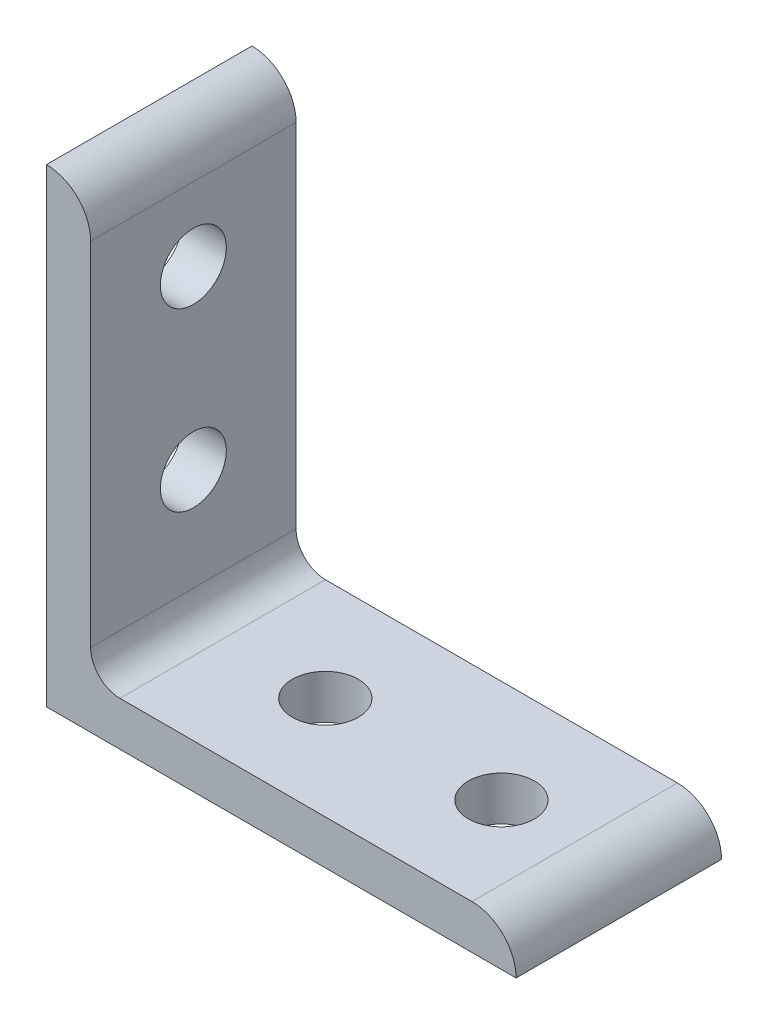
ISO-10303-21;
HEADER;
FILE_DESCRIPTION(('STEP AP214'),'2;1');
FILE_NAME('part.step','',(''),(''),'','','');
FILE_SCHEMA(('AUTOMOTIVE_DESIGN { 1 0 10303 214 1 1 1 1 }'));
ENDSEC;
DATA;
#1=APPLICATION_CONTEXT('core data for automotive mechanical design processes');
#2=APPLICATION_PROTOCOL_DEFINITION('international standard','automotive_design',2000,#1);
#3=PRODUCT_CONTEXT('',#1,'mechanical');
#4=PRODUCT('Part','Part','',(#3));
#5=PRODUCT_RELATED_PRODUCT_CATEGORY('part','',(#4));
#6=PRODUCT_DEFINITION_FORMATION('','',#4);
#7=PRODUCT_DEFINITION_CONTEXT('part definition',#1,'design');
#8=PRODUCT_DEFINITION('design','',#6,#7);
#9=PRODUCT_DEFINITION_SHAPE('','',#8);
#10=(LENGTH_UNIT() NAMED_UNIT(*) SI_UNIT(.MILLI.,.METRE.));
#11=(NAMED_UNIT(*) PLANE_ANGLE_UNIT() SI_UNIT($,.RADIAN.));
#12=(NAMED_UNIT(*) SI_UNIT($,.STERADIAN.) SOLID_ANGLE_UNIT());
#13=UNCERTAINTY_MEASURE_WITH_UNIT(LENGTH_MEASURE(1.E-05),#10,'distance_accuracy_value','');
#14=(GEOMETRIC_REPRESENTATION_CONTEXT(3) GLOBAL_UNCERTAINTY_ASSIGNED_CONTEXT((#13)) GLOBAL_UNIT_ASSIGNED_CONTEXT((#10,
#11,#12)) REPRESENTATION_CONTEXT('',''));
#15=CARTESIAN_POINT('',(0.,0.,0.));
#16=DIRECTION('',(0.,0.,1.));
#17=DIRECTION('',(1.,0.,0.));
#18=AXIS2_PLACEMENT_3D('',#15,#16,#17);
#19=CARTESIAN_POINT('',(4.7752,46.0248,11.1125));
#20=DIRECTION('',(-1.,0.,0.));
#21=DIRECTION('',(0.,-1.,0.));
#22=AXIS2_PLACEMENT_3D('',#19,#20,#21);
#23=PLANE('',#22);
#24=DIRECTION('',(0.,1.,0.));
#25=VECTOR('',#24,1.);
#26=CARTESIAN_POINT('',(4.7752,46.0248,-11.1125));
#27=LINE('',#26,#25);
#28=CARTESIAN_POINT('',(4.7752,7.9502,-11.1125));
#29=VERTEX_POINT('',#28);
#30=CARTESIAN_POINT('',(4.77519999999999,46.0248,-11.1125));
#31=VERTEX_POINT('',#30);
#32=EDGE_CURVE('E119',#29,#31,#27,.T.);
#33=ORIENTED_EDGE('',*,*,#32,.T.);
#34=DIRECTION('',(0.,0.,-1.));
#35=VECTOR('',#34,1.);
#36=CARTESIAN_POINT('',(4.77519999999999,46.0248,11.1125));
#37=LINE('',#36,#35);
#38=CARTESIAN_POINT('',(4.77519999999999,46.0248,11.1125));
#39=VERTEX_POINT('',#38);
#40=EDGE_CURVE('E116',#39,#31,#37,.T.);
#41=ORIENTED_EDGE('',*,*,#40,.F.);
#42=DIRECTION('',(0.,1.,0.));
#43=VECTOR('',#42,1.);
#44=CARTESIAN_POINT('',(4.7752,46.0248,11.1125));
#45=LINE('',#44,#43);
#46=CARTESIAN_POINT('',(4.7752,7.9502,11.1125));
#47=VERTEX_POINT('',#46);
#48=EDGE_CURVE('E105',#47,#39,#45,.T.);
#49=ORIENTED_EDGE('',*,*,#48,.F.);
#50=DIRECTION('',(0.,0.,-1.));
#51=VECTOR('',#50,1.);
#52=CARTESIAN_POINT('',(4.7752,7.9502,11.1125));
#53=LINE('',#52,#51);
#54=EDGE_CURVE('E120',#47,#29,#53,.T.);
#55=ORIENTED_EDGE('',*,*,#54,.T.);
#56=EDGE_LOOP('',(#33,#41,#49,#55));
#57=FACE_BOUND('',#56,.T.);
#58=CARTESIAN_POINT('',(4.7752,19.05,0.));
#59=DIRECTION('',(-1.,0.,0.));
#60=DIRECTION('',(0.,-1.,0.));
#61=AXIS2_PLACEMENT_3D('',#58,#59,#60);
#62=CIRCLE('',#61,3.5687);
#63=CARTESIAN_POINT('',(4.7752,15.4813,0.));
#64=VERTEX_POINT('',#63);
#65=EDGE_CURVE('E198',#64,#64,#62,.F.);
#66=ORIENTED_EDGE('',*,*,#65,.F.);
#67=EDGE_LOOP('',(#66));
#68=FACE_BOUND('',#67,.T.);
#69=CARTESIAN_POINT('',(4.77519999999999,38.1,0.));
#70=DIRECTION('',(-1.,0.,0.));
#71=DIRECTION('',(0.,-1.,0.));
#72=AXIS2_PLACEMENT_3D('',#69,#70,#71);
#73=CIRCLE('',#72,3.5687);
#74=CARTESIAN_POINT('',(4.77519999999999,34.5313,0.));
#75=VERTEX_POINT('',#74);
#76=EDGE_CURVE('E193',#75,#75,#73,.F.);
#77=ORIENTED_EDGE('',*,*,#76,.F.);
#78=EDGE_LOOP('',(#77));
#79=FACE_BOUND('',#78,.T.);
#80=ADVANCED_FACE('F36',(#57,#68,#79),#23,.F.);
#81=CARTESIAN_POINT('',(0.,0.,11.1125));
#82=DIRECTION('',(1.,0.,0.));
#83=DIRECTION('',(0.,0.,-1.));
#84=AXIS2_PLACEMENT_3D('',#81,#82,#83);
#85=PLANE('',#84);
#86=DIRECTION('',(0.,-1.,0.));
#87=VECTOR('',#86,1.);
#88=CARTESIAN_POINT('',(0.,0.,-11.1125));
#89=LINE('',#88,#87);
#90=CARTESIAN_POINT('',(0.,50.8,-11.1125));
#91=VERTEX_POINT('',#90);
#92=CARTESIAN_POINT('',(0.,0.,-11.1125));
#93=VERTEX_POINT('',#92);
#94=EDGE_CURVE('E87',#91,#93,#89,.T.);
#95=ORIENTED_EDGE('',*,*,#94,.T.);
#96=DIRECTION('',(0.,0.,-1.));
#97=VECTOR('',#96,1.);
#98=CARTESIAN_POINT('',(0.,0.,11.1125));
#99=LINE('',#98,#97);
#100=CARTESIAN_POINT('',(0.,0.,11.1125));
#101=VERTEX_POINT('',#100);
#102=EDGE_CURVE('E125',#101,#93,#99,.T.);
#103=ORIENTED_EDGE('',*,*,#102,.F.);
#104=DIRECTION('',(0.,-1.,0.));
#105=VECTOR('',#104,1.);
#106=CARTESIAN_POINT('',(0.,0.,11.1125));
#107=LINE('',#106,#105);
#108=CARTESIAN_POINT('',(0.,50.8,11.1125));
#109=VERTEX_POINT('',#108);
#110=EDGE_CURVE('E55',#109,#101,#107,.T.);
#111=ORIENTED_EDGE('',*,*,#110,.F.);
#112=DIRECTION('',(0.,0.,-1.));
#113=VECTOR('',#112,1.);
#114=CARTESIAN_POINT('',(0.,50.8,11.1125));
#115=LINE('',#114,#113);
#116=EDGE_CURVE('E121',#109,#91,#115,.T.);
#117=ORIENTED_EDGE('',*,*,#116,.T.);
#118=EDGE_LOOP('',(#95,#103,#111,#117));
#119=FACE_BOUND('',#118,.T.);
#120=CARTESIAN_POINT('',(0.,19.05,0.));
#121=DIRECTION('',(1.,0.,0.));
#122=DIRECTION('',(0.,0.,-1.));
#123=AXIS2_PLACEMENT_3D('',#120,#121,#122);
#124=CIRCLE('',#123,3.5687);
#125=CARTESIAN_POINT('',(0.,19.05,-3.5687));
#126=VERTEX_POINT('',#125);
#127=EDGE_CURVE('E188',#126,#126,#124,.T.);
#128=ORIENTED_EDGE('',*,*,#127,.T.);
#129=EDGE_LOOP('',(#128));
#130=FACE_BOUND('',#129,.T.);
#131=CARTESIAN_POINT('',(0.,38.1,0.));
#132=DIRECTION('',(1.,0.,0.));
#133=DIRECTION('',(0.,0.,-1.));
#134=AXIS2_PLACEMENT_3D('',#131,#132,#133);
#135=CIRCLE('',#134,3.5687);
#136=CARTESIAN_POINT('',(0.,38.1,-3.5687));
#137=VERTEX_POINT('',#136);
#138=EDGE_CURVE('E191',#137,#137,#135,.T.);
#139=ORIENTED_EDGE('',*,*,#138,.T.);
#140=EDGE_LOOP('',(#139));
#141=FACE_BOUND('',#140,.T.);
#142=ADVANCED_FACE('F181',(#119,#130,#141),#85,.F.);
#143=CARTESIAN_POINT('',(50.8,0.,11.1125));
#144=DIRECTION('',(0.,1.,0.));
#145=DIRECTION('',(-1.,0.,0.));
#146=AXIS2_PLACEMENT_3D('',#143,#144,#145);
#147=PLANE('',#146);
#148=DIRECTION('',(1.,0.,0.));
#149=VECTOR('',#148,1.);
#150=CARTESIAN_POINT('',(50.8,0.,-11.1125));
#151=LINE('',#150,#149);
#152=CARTESIAN_POINT('',(50.8,0.,-11.1125));
#153=VERTEX_POINT('',#152);
#154=EDGE_CURVE('E129',#93,#153,#151,.T.);
#155=ORIENTED_EDGE('',*,*,#154,.T.);
#156=DIRECTION('',(0.,0.,-1.));
#157=VECTOR('',#156,1.);
#158=CARTESIAN_POINT('',(50.8,0.,11.1125));
#159=LINE('',#158,#157);
#160=CARTESIAN_POINT('',(50.8,0.,11.1125));
#161=VERTEX_POINT('',#160);
#162=EDGE_CURVE('E11',#161,#153,#159,.T.);
#163=ORIENTED_EDGE('',*,*,#162,.F.);
#164=DIRECTION('',(1.,0.,0.));
#165=VECTOR('',#164,1.);
#166=CARTESIAN_POINT('',(50.8,0.,11.1125));
#167=LINE('',#166,#165);
#168=EDGE_CURVE('E142',#101,#161,#167,.T.);
#169=ORIENTED_EDGE('',*,*,#168,.F.);
#170=ORIENTED_EDGE('',*,*,#102,.T.);
#171=EDGE_LOOP('',(#155,#163,#169,#170));
#172=FACE_BOUND('',#171,.T.);
#173=CARTESIAN_POINT('',(19.05,0.,0.));
#174=DIRECTION('',(0.,1.,0.));
#175=DIRECTION('',(0.,0.,1.));
#176=AXIS2_PLACEMENT_3D('',#173,#174,#175);
#177=CIRCLE('',#176,3.5687);
#178=CARTESIAN_POINT('',(19.05,0.,3.5687));
#179=VERTEX_POINT('',#178);
#180=EDGE_CURVE('E151',#179,#179,#177,.T.);
#181=ORIENTED_EDGE('',*,*,#180,.T.);
#182=EDGE_LOOP('',(#181));
#183=FACE_BOUND('',#182,.T.);
#184=CARTESIAN_POINT('',(38.1,0.,0.));
#185=DIRECTION('',(0.,1.,0.));
#186=DIRECTION('',(0.,0.,1.));
#187=AXIS2_PLACEMENT_3D('',#184,#185,#186);
#188=CIRCLE('',#187,3.56869999999999);
#189=CARTESIAN_POINT('',(38.1,0.,3.56869999999999));
#190=VERTEX_POINT('',#189);
#191=EDGE_CURVE('E159',#190,#190,#188,.T.);
#192=ORIENTED_EDGE('',*,*,#191,.T.);
#193=EDGE_LOOP('',(#192));
#194=FACE_BOUND('',#193,.T.);
#195=ADVANCED_FACE('F38',(#172,#183,#194),#147,.F.);
#196=CARTESIAN_POINT('',(7.9502,4.7752,11.1125));
#197=DIRECTION('',(0.,-1.,0.));
#198=DIRECTION('',(1.,0.,0.));
#199=AXIS2_PLACEMENT_3D('',#196,#197,#198);
#200=PLANE('',#199);
#201=DIRECTION('',(-1.,0.,0.));
#202=VECTOR('',#201,1.);
#203=CARTESIAN_POINT('',(7.9502,4.7752,-11.1125));
#204=LINE('',#203,#202);
#205=CARTESIAN_POINT('',(46.0248,4.7752,-11.1125));
#206=VERTEX_POINT('',#205);
#207=CARTESIAN_POINT('',(7.9502,4.7752,-11.1125));
#208=VERTEX_POINT('',#207);
#209=EDGE_CURVE('E135',#206,#208,#204,.T.);
#210=ORIENTED_EDGE('',*,*,#209,.T.);
#211=DIRECTION('',(0.,0.,-1.));
#212=VECTOR('',#211,1.);
#213=CARTESIAN_POINT('',(7.9502,4.7752,11.1125));
#214=LINE('',#213,#212);
#215=CARTESIAN_POINT('',(7.9502,4.7752,11.1125));
#216=VERTEX_POINT('',#215);
#217=EDGE_CURVE('E146',#216,#208,#214,.T.);
#218=ORIENTED_EDGE('',*,*,#217,.F.);
#219=DIRECTION('',(-1.,0.,0.));
#220=VECTOR('',#219,1.);
#221=CARTESIAN_POINT('',(7.9502,4.7752,11.1125));
#222=LINE('',#221,#220);
#223=CARTESIAN_POINT('',(46.0248,4.7752,11.1125));
#224=VERTEX_POINT('',#223);
#225=EDGE_CURVE('E165',#224,#216,#222,.T.);
#226=ORIENTED_EDGE('',*,*,#225,.F.);
#227=DIRECTION('',(0.,0.,-1.));
#228=VECTOR('',#227,1.);
#229=CARTESIAN_POINT('',(46.0248,4.7752,11.1125));
#230=LINE('',#229,#228);
#231=EDGE_CURVE('E46',#224,#206,#230,.T.);
#232=ORIENTED_EDGE('',*,*,#231,.T.);
#233=EDGE_LOOP('',(#210,#218,#226,#232));
#234=FACE_BOUND('',#233,.T.);
#235=CARTESIAN_POINT('',(19.05,4.7752,0.));
#236=DIRECTION('',(0.,-1.,0.));
#237=DIRECTION('',(1.,0.,0.));
#238=AXIS2_PLACEMENT_3D('',#235,#236,#237);
#239=CIRCLE('',#238,3.5687);
#240=CARTESIAN_POINT('',(22.6187,4.7752,0.));
#241=VERTEX_POINT('',#240);
#242=EDGE_CURVE('E133',#241,#241,#239,.F.);
#243=ORIENTED_EDGE('',*,*,#242,.F.);
#244=EDGE_LOOP('',(#243));
#245=FACE_BOUND('',#244,.T.);
#246=CARTESIAN_POINT('',(38.1,4.7752,0.));
#247=DIRECTION('',(0.,-1.,0.));
#248=DIRECTION('',(1.,0.,0.));
#249=AXIS2_PLACEMENT_3D('',#246,#247,#248);
#250=CIRCLE('',#249,3.56869999999999);
#251=CARTESIAN_POINT('',(41.6687,4.7752,0.));
#252=VERTEX_POINT('',#251);
#253=EDGE_CURVE('E40',#252,#252,#250,.F.);
#254=ORIENTED_EDGE('',*,*,#253,.F.);
#255=EDGE_LOOP('',(#254));
#256=FACE_BOUND('',#255,.T.);
#257=ADVANCED_FACE('F169',(#234,#245,#256),#200,.F.);
#258=CARTESIAN_POINT('',(46.0248,0.,11.1125));
#259=DIRECTION('',(0.,0.,-1.));
#260=DIRECTION('',(-1.,0.,0.));
#261=AXIS2_PLACEMENT_3D('',#258,#259,#260);
#262=CYLINDRICAL_SURFACE('',#261,4.7752);
#263=CARTESIAN_POINT('',(46.0248,0.,-11.1125));
#264=DIRECTION('',(0.,0.,1.));
#265=DIRECTION('',(1.,0.,0.));
#266=AXIS2_PLACEMENT_3D('',#263,#264,#265);
#267=CIRCLE('',#266,4.7752);
#268=EDGE_CURVE('E132',#153,#206,#267,.T.);
#269=ORIENTED_EDGE('',*,*,#268,.T.);
#270=ORIENTED_EDGE('',*,*,#231,.F.);
#271=CARTESIAN_POINT('',(46.0248,0.,11.1125));
#272=DIRECTION('',(0.,0.,1.));
#273=DIRECTION('',(1.,0.,0.));
#274=AXIS2_PLACEMENT_3D('',#271,#272,#273);
#275=CIRCLE('',#274,4.7752);
#276=EDGE_CURVE('E95',#161,#224,#275,.T.);
#277=ORIENTED_EDGE('',*,*,#276,.F.);
#278=ORIENTED_EDGE('',*,*,#162,.T.);
#279=EDGE_LOOP('',(#269,#270,#277,#278));
#280=FACE_BOUND('',#279,.T.);
#281=ADVANCED_FACE('F215',(#280),#262,.T.);
#282=CARTESIAN_POINT('',(7.9502,7.9502,11.1125));
#283=DIRECTION('',(0.,0.,-1.));
#284=DIRECTION('',(-1.,0.,0.));
#285=AXIS2_PLACEMENT_3D('',#282,#283,#284);
#286=CYLINDRICAL_SURFACE('',#285,3.175);
#287=CARTESIAN_POINT('',(7.9502,7.9502,-11.1125));
#288=DIRECTION('',(0.,0.,-1.));
#289=DIRECTION('',(1.,0.,0.));
#290=AXIS2_PLACEMENT_3D('',#287,#288,#289);
#291=CIRCLE('',#290,3.175);
#292=EDGE_CURVE('E137',#208,#29,#291,.T.);
#293=ORIENTED_EDGE('',*,*,#292,.T.);
#294=ORIENTED_EDGE('',*,*,#54,.F.);
#295=CARTESIAN_POINT('',(7.9502,7.9502,11.1125));
#296=DIRECTION('',(0.,0.,-1.));
#297=DIRECTION('',(1.,0.,0.));
#298=AXIS2_PLACEMENT_3D('',#295,#296,#297);
#299=CIRCLE('',#298,3.175);
#300=EDGE_CURVE('E111',#216,#47,#299,.T.);
#301=ORIENTED_EDGE('',*,*,#300,.F.);
#302=ORIENTED_EDGE('',*,*,#217,.T.);
#303=EDGE_LOOP('',(#293,#294,#301,#302));
#304=FACE_BOUND('',#303,.T.);
#305=ADVANCED_FACE('F174',(#304),#286,.F.);
#306=CARTESIAN_POINT('',(0.,46.0248,11.1125));
#307=DIRECTION('',(0.,0.,-1.));
#308=DIRECTION('',(-1.,0.,0.));
#309=AXIS2_PLACEMENT_3D('',#306,#307,#308);
#310=CYLINDRICAL_SURFACE('',#309,4.77519999999999);
#311=CARTESIAN_POINT('',(0.,46.0248,-11.1125));
#312=DIRECTION('',(0.,0.,1.));
#313=DIRECTION('',(1.,0.,0.));
#314=AXIS2_PLACEMENT_3D('',#311,#312,#313);
#315=CIRCLE('',#314,4.77519999999999);
#316=EDGE_CURVE('E81',#31,#91,#315,.T.);
#317=ORIENTED_EDGE('',*,*,#316,.T.);
#318=ORIENTED_EDGE('',*,*,#116,.F.);
#319=CARTESIAN_POINT('',(0.,46.0248,11.1125));
#320=DIRECTION('',(0.,0.,1.));
#321=DIRECTION('',(1.,0.,0.));
#322=AXIS2_PLACEMENT_3D('',#319,#320,#321);
#323=CIRCLE('',#322,4.77519999999999);
#324=EDGE_CURVE('E109',#39,#109,#323,.T.);
#325=ORIENTED_EDGE('',*,*,#324,.F.);
#326=ORIENTED_EDGE('',*,*,#40,.T.);
#327=EDGE_LOOP('',(#317,#318,#325,#326));
#328=FACE_BOUND('',#327,.T.);
#329=ADVANCED_FACE('F123',(#328),#310,.T.);
#330=CARTESIAN_POINT('',(0.,46.0248,11.1125));
#331=DIRECTION('',(0.,0.,1.));
#332=DIRECTION('',(1.,0.,0.));
#333=AXIS2_PLACEMENT_3D('',#330,#331,#332);
#334=PLANE('',#333);
#335=ORIENTED_EDGE('',*,*,#168,.T.);
#336=ORIENTED_EDGE('',*,*,#276,.T.);
#337=ORIENTED_EDGE('',*,*,#225,.T.);
#338=ORIENTED_EDGE('',*,*,#300,.T.);
#339=ORIENTED_EDGE('',*,*,#48,.T.);
#340=ORIENTED_EDGE('',*,*,#324,.T.);
#341=ORIENTED_EDGE('',*,*,#110,.T.);
#342=EDGE_LOOP('',(#335,#336,#337,#338,#339,#340,#341));
#343=FACE_BOUND('',#342,.T.);
#344=ADVANCED_FACE('F107',(#343),#334,.T.);
#345=CARTESIAN_POINT('',(0.,46.0248,-11.1125));
#346=DIRECTION('',(0.,0.,1.));
#347=DIRECTION('',(1.,0.,0.));
#348=AXIS2_PLACEMENT_3D('',#345,#346,#347);
#349=PLANE('',#348);
#350=ORIENTED_EDGE('',*,*,#154,.F.);
#351=ORIENTED_EDGE('',*,*,#94,.F.);
#352=ORIENTED_EDGE('',*,*,#316,.F.);
#353=ORIENTED_EDGE('',*,*,#32,.F.);
#354=ORIENTED_EDGE('',*,*,#292,.F.);
#355=ORIENTED_EDGE('',*,*,#209,.F.);
#356=ORIENTED_EDGE('',*,*,#268,.F.);
#357=EDGE_LOOP('',(#350,#351,#352,#353,#354,#355,#356));
#358=FACE_BOUND('',#357,.T.);
#359=ADVANCED_FACE('F177',(#358),#349,.F.);
#360=CARTESIAN_POINT('',(19.05,50.8,0.));
#361=DIRECTION('',(0.,-1.,0.));
#362=DIRECTION('',(0.,0.,-1.));
#363=AXIS2_PLACEMENT_3D('',#360,#361,#362);
#364=CYLINDRICAL_SURFACE('',#363,3.5687);
#365=ORIENTED_EDGE('',*,*,#180,.F.);
#366=EDGE_LOOP('',(#365));
#367=FACE_BOUND('',#366,.T.);
#368=ORIENTED_EDGE('',*,*,#242,.T.);
#369=EDGE_LOOP('',(#368));
#370=FACE_BOUND('',#369,.T.);
#371=ADVANCED_FACE('F210',(#367,#370),#364,.F.);
#372=CARTESIAN_POINT('',(38.1,50.8,0.));
#373=DIRECTION('',(0.,-1.,0.));
#374=DIRECTION('',(0.,0.,-1.));
#375=AXIS2_PLACEMENT_3D('',#372,#373,#374);
#376=CYLINDRICAL_SURFACE('',#375,3.56869999999999);
#377=ORIENTED_EDGE('',*,*,#191,.F.);
#378=EDGE_LOOP('',(#377));
#379=FACE_BOUND('',#378,.T.);
#380=ORIENTED_EDGE('',*,*,#253,.T.);
#381=EDGE_LOOP('',(#380));
#382=FACE_BOUND('',#381,.T.);
#383=ADVANCED_FACE('F206',(#379,#382),#376,.F.);
#384=CARTESIAN_POINT('',(50.8,19.05,0.));
#385=DIRECTION('',(-1.,0.,0.));
#386=DIRECTION('',(0.,0.,1.));
#387=AXIS2_PLACEMENT_3D('',#384,#385,#386);
#388=CYLINDRICAL_SURFACE('',#387,3.5687);
#389=ORIENTED_EDGE('',*,*,#127,.F.);
#390=EDGE_LOOP('',(#389));
#391=FACE_BOUND('',#390,.T.);
#392=ORIENTED_EDGE('',*,*,#65,.T.);
#393=EDGE_LOOP('',(#392));
#394=FACE_BOUND('',#393,.T.);
#395=ADVANCED_FACE('F209',(#391,#394),#388,.F.);
#396=CARTESIAN_POINT('',(50.8,38.1,0.));
#397=DIRECTION('',(-1.,0.,0.));
#398=DIRECTION('',(0.,0.,1.));
#399=AXIS2_PLACEMENT_3D('',#396,#397,#398);
#400=CYLINDRICAL_SURFACE('',#399,3.5687);
#401=ORIENTED_EDGE('',*,*,#138,.F.);
#402=EDGE_LOOP('',(#401));
#403=FACE_BOUND('',#402,.T.);
#404=ORIENTED_EDGE('',*,*,#76,.T.);
#405=EDGE_LOOP('',(#404));
#406=FACE_BOUND('',#405,.T.);
#407=ADVANCED_FACE('F245',(#403,#406),#400,.F.);
#408=CLOSED_SHELL('',(#80,#142,#195,#257,#281,#305,#329,#344,#359,#371,#383,#395,#407));
#409=MANIFOLD_SOLID_BREP('B2',#408);
#410=ADVANCED_BREP_SHAPE_REPRESENTATION('',(#18,#409),#14);
#411=SHAPE_DEFINITION_REPRESENTATION(#9,#410);
ENDSEC;
END-ISO-10303-21;
